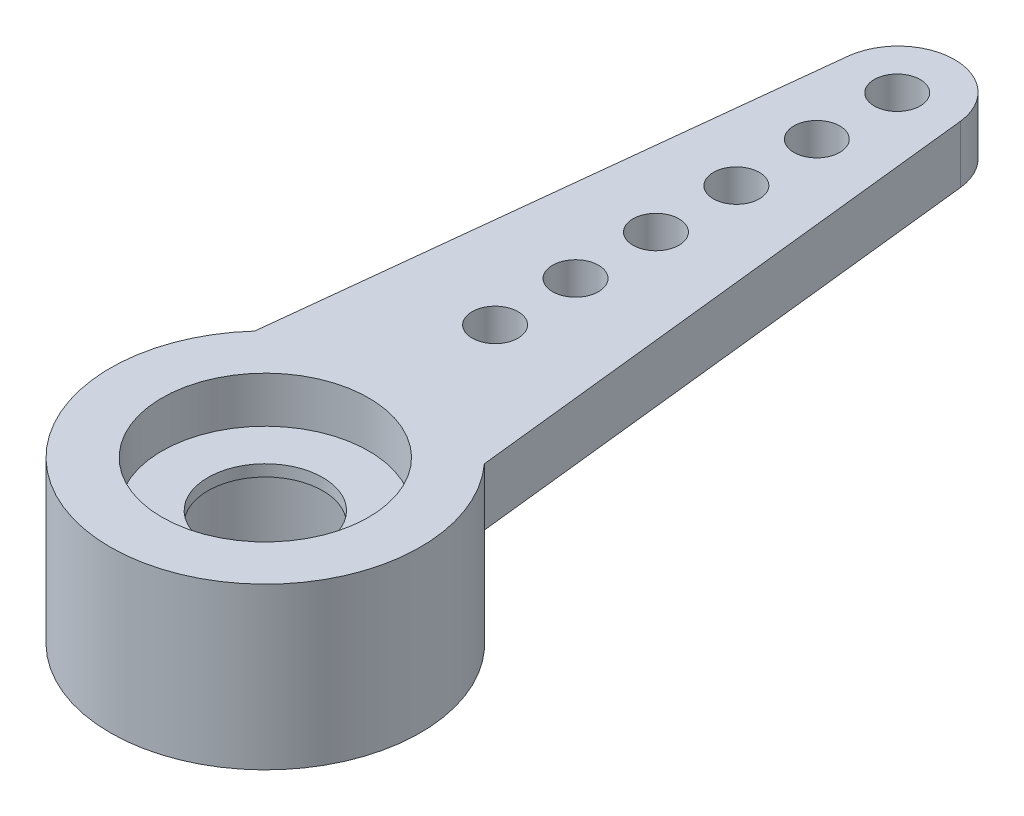
ISO-10303-21;
HEADER;
FILE_DESCRIPTION(('STEP AP214'),'2;1');
FILE_NAME('part.step','',(''),(''),'','','');
FILE_SCHEMA(('AUTOMOTIVE_DESIGN { 1 0 10303 214 1 1 1 1 }'));
ENDSEC;
DATA;
#1=APPLICATION_CONTEXT('core data for automotive mechanical design processes');
#2=APPLICATION_PROTOCOL_DEFINITION('international standard','automotive_design',2000,#1);
#3=PRODUCT_CONTEXT('',#1,'mechanical');
#4=PRODUCT('Part','Part','',(#3));
#5=PRODUCT_RELATED_PRODUCT_CATEGORY('part','',(#4));
#6=PRODUCT_DEFINITION_FORMATION('','',#4);
#7=PRODUCT_DEFINITION_CONTEXT('part definition',#1,'design');
#8=PRODUCT_DEFINITION('design','',#6,#7);
#9=PRODUCT_DEFINITION_SHAPE('','',#8);
#10=(LENGTH_UNIT() NAMED_UNIT(*) SI_UNIT(.MILLI.,.METRE.));
#11=(NAMED_UNIT(*) PLANE_ANGLE_UNIT() SI_UNIT($,.RADIAN.));
#12=(NAMED_UNIT(*) SI_UNIT($,.STERADIAN.) SOLID_ANGLE_UNIT());
#13=UNCERTAINTY_MEASURE_WITH_UNIT(LENGTH_MEASURE(1.E-05),#10,'distance_accuracy_value','');
#14=(GEOMETRIC_REPRESENTATION_CONTEXT(3) GLOBAL_UNCERTAINTY_ASSIGNED_CONTEXT((#13)) GLOBAL_UNIT_ASSIGNED_CONTEXT((#10,
#11,#12)) REPRESENTATION_CONTEXT('',''));
#15=CARTESIAN_POINT('',(0.,0.,0.));
#16=DIRECTION('',(0.,0.,1.));
#17=DIRECTION('',(1.,0.,0.));
#18=AXIS2_PLACEMENT_3D('',#15,#16,#17);
#19=CARTESIAN_POINT('',(0.,0.,-12.192));
#20=DIRECTION('',(0.,1.,0.));
#21=DIRECTION('',(0.,0.,1.));
#22=AXIS2_PLACEMENT_3D('',#19,#20,#21);
#23=CYLINDRICAL_SURFACE('',#22,0.508);
#24=CARTESIAN_POINT('',(0.,3.556,-12.192));
#25=DIRECTION('',(0.,1.,0.));
#26=DIRECTION('',(0.,0.,1.));
#27=AXIS2_PLACEMENT_3D('',#24,#25,#26);
#28=CIRCLE('',#27,0.508);
#29=CARTESIAN_POINT('',(0.,3.556,-11.684));
#30=VERTEX_POINT('',#29);
#31=EDGE_CURVE('E52',#30,#30,#28,.T.);
#32=ORIENTED_EDGE('',*,*,#31,.T.);
#33=EDGE_LOOP('',(#32));
#34=FACE_BOUND('',#33,.T.);
#35=CARTESIAN_POINT('',(0.,2.286,-12.192));
#36=DIRECTION('',(0.,1.,0.));
#37=DIRECTION('',(0.,0.,1.));
#38=AXIS2_PLACEMENT_3D('',#35,#36,#37);
#39=CIRCLE('',#38,0.508);
#40=CARTESIAN_POINT('',(0.,2.286,-11.684));
#41=VERTEX_POINT('',#40);
#42=EDGE_CURVE('E11',#41,#41,#39,.T.);
#43=ORIENTED_EDGE('',*,*,#42,.F.);
#44=EDGE_LOOP('',(#43));
#45=FACE_BOUND('',#44,.T.);
#46=ADVANCED_FACE('F43',(#34,#45),#23,.F.);
#47=CARTESIAN_POINT('',(0.,0.,-10.414));
#48=DIRECTION('',(0.,1.,0.));
#49=DIRECTION('',(0.,0.,1.));
#50=AXIS2_PLACEMENT_3D('',#47,#48,#49);
#51=CYLINDRICAL_SURFACE('',#50,0.508);
#52=CARTESIAN_POINT('',(0.,3.556,-10.414));
#53=DIRECTION('',(0.,1.,0.));
#54=DIRECTION('',(0.,0.,1.));
#55=AXIS2_PLACEMENT_3D('',#52,#53,#54);
#56=CIRCLE('',#55,0.508);
#57=CARTESIAN_POINT('',(0.,3.556,-9.906));
#58=VERTEX_POINT('',#57);
#59=EDGE_CURVE('E174',#58,#58,#56,.T.);
#60=ORIENTED_EDGE('',*,*,#59,.T.);
#61=EDGE_LOOP('',(#60));
#62=FACE_BOUND('',#61,.T.);
#63=CARTESIAN_POINT('',(0.,2.286,-10.414));
#64=DIRECTION('',(0.,1.,0.));
#65=DIRECTION('',(0.,0.,1.));
#66=AXIS2_PLACEMENT_3D('',#63,#64,#65);
#67=CIRCLE('',#66,0.508);
#68=CARTESIAN_POINT('',(0.,2.286,-9.906));
#69=VERTEX_POINT('',#68);
#70=EDGE_CURVE('E178',#69,#69,#67,.T.);
#71=ORIENTED_EDGE('',*,*,#70,.F.);
#72=EDGE_LOOP('',(#71));
#73=FACE_BOUND('',#72,.T.);
#74=ADVANCED_FACE('F208',(#62,#73),#51,.F.);
#75=CARTESIAN_POINT('',(0.,0.,-8.636));
#76=DIRECTION('',(0.,1.,0.));
#77=DIRECTION('',(0.,0.,1.));
#78=AXIS2_PLACEMENT_3D('',#75,#76,#77);
#79=CYLINDRICAL_SURFACE('',#78,0.508);
#80=CARTESIAN_POINT('',(0.,3.556,-8.636));
#81=DIRECTION('',(0.,1.,0.));
#82=DIRECTION('',(0.,0.,1.));
#83=AXIS2_PLACEMENT_3D('',#80,#81,#82);
#84=CIRCLE('',#83,0.508);
#85=CARTESIAN_POINT('',(0.,3.556,-8.128));
#86=VERTEX_POINT('',#85);
#87=EDGE_CURVE('E160',#86,#86,#84,.T.);
#88=ORIENTED_EDGE('',*,*,#87,.T.);
#89=EDGE_LOOP('',(#88));
#90=FACE_BOUND('',#89,.T.);
#91=CARTESIAN_POINT('',(0.,2.286,-8.636));
#92=DIRECTION('',(0.,1.,0.));
#93=DIRECTION('',(0.,0.,1.));
#94=AXIS2_PLACEMENT_3D('',#91,#92,#93);
#95=CIRCLE('',#94,0.508);
#96=CARTESIAN_POINT('',(0.,2.286,-8.128));
#97=VERTEX_POINT('',#96);
#98=EDGE_CURVE('E170',#97,#97,#95,.T.);
#99=ORIENTED_EDGE('',*,*,#98,.F.);
#100=EDGE_LOOP('',(#99));
#101=FACE_BOUND('',#100,.T.);
#102=ADVANCED_FACE('F212',(#90,#101),#79,.F.);
#103=CARTESIAN_POINT('',(0.,3.556,0.));
#104=DIRECTION('',(0.,-1.,0.));
#105=DIRECTION('',(0.,0.,-1.));
#106=AXIS2_PLACEMENT_3D('',#103,#104,#105);
#107=CYLINDRICAL_SURFACE('',#106,2.286);
#108=CARTESIAN_POINT('',(0.,0.,0.));
#109=DIRECTION('',(0.,1.,0.));
#110=DIRECTION('',(0.,0.,1.));
#111=AXIS2_PLACEMENT_3D('',#108,#109,#110);
#112=CIRCLE('',#111,2.286);
#113=CARTESIAN_POINT('',(0.,0.,2.286));
#114=VERTEX_POINT('',#113);
#115=EDGE_CURVE('E136',#114,#114,#112,.T.);
#116=ORIENTED_EDGE('',*,*,#115,.F.);
#117=EDGE_LOOP('',(#116));
#118=FACE_BOUND('',#117,.T.);
#119=CARTESIAN_POINT('',(0.,2.286,0.));
#120=DIRECTION('',(0.,1.,0.));
#121=DIRECTION('',(0.,0.,1.));
#122=AXIS2_PLACEMENT_3D('',#119,#120,#121);
#123=CIRCLE('',#122,2.286);
#124=CARTESIAN_POINT('',(0.,2.286,2.286));
#125=VERTEX_POINT('',#124);
#126=EDGE_CURVE('E259',#125,#125,#123,.F.);
#127=ORIENTED_EDGE('',*,*,#126,.F.);
#128=EDGE_LOOP('',(#127));
#129=FACE_BOUND('',#128,.T.);
#130=ADVANCED_FACE('F201',(#118,#129),#107,.F.);
#131=CARTESIAN_POINT('',(0.,3.556,0.));
#132=DIRECTION('',(0.,-1.,0.));
#133=DIRECTION('',(0.,0.,-1.));
#134=AXIS2_PLACEMENT_3D('',#131,#132,#133);
#135=CYLINDRICAL_SURFACE('',#134,3.429);
#136=CARTESIAN_POINT('',(0.,0.,0.));
#137=DIRECTION('',(0.,1.,0.));
#138=DIRECTION('',(0.,0.,1.));
#139=AXIS2_PLACEMENT_3D('',#136,#137,#138);
#140=CIRCLE('',#139,3.429);
#141=CARTESIAN_POINT('',(0.,0.,3.429));
#142=VERTEX_POINT('',#141);
#143=EDGE_CURVE('E145',#142,#142,#140,.T.);
#144=ORIENTED_EDGE('',*,*,#143,.T.);
#145=EDGE_LOOP('',(#144));
#146=FACE_BOUND('',#145,.T.);
#147=DIRECTION('',(0.,1.,0.));
#148=VECTOR('',#147,1.);
#149=CARTESIAN_POINT('',(-2.54,2.286,-2.30357135769657));
#150=LINE('',#149,#148);
#151=CARTESIAN_POINT('',(-2.54,2.286,-2.30357135769657));
#152=VERTEX_POINT('',#151);
#153=CARTESIAN_POINT('',(-2.54,3.556,-2.30357135769657));
#154=VERTEX_POINT('',#153);
#155=EDGE_CURVE('E61',#152,#154,#150,.T.);
#156=ORIENTED_EDGE('',*,*,#155,.F.);
#157=CARTESIAN_POINT('',(0.,2.286,0.));
#158=DIRECTION('',(0.,1.,0.));
#159=DIRECTION('',(0.,0.,1.));
#160=AXIS2_PLACEMENT_3D('',#157,#158,#159);
#161=CIRCLE('',#160,3.429);
#162=CARTESIAN_POINT('',(2.54,2.286,-2.30357135769657));
#163=VERTEX_POINT('',#162);
#164=EDGE_CURVE('E117',#163,#152,#161,.T.);
#165=ORIENTED_EDGE('',*,*,#164,.F.);
#166=DIRECTION('',(0.,1.,0.));
#167=VECTOR('',#166,1.);
#168=CARTESIAN_POINT('',(2.54,2.286,-2.30357135769657));
#169=LINE('',#168,#167);
#170=CARTESIAN_POINT('',(2.54,3.556,-2.30357135769657));
#171=VERTEX_POINT('',#170);
#172=EDGE_CURVE('E92',#163,#171,#169,.T.);
#173=ORIENTED_EDGE('',*,*,#172,.T.);
#174=CARTESIAN_POINT('',(0.,3.556,0.));
#175=DIRECTION('',(0.,1.,0.));
#176=DIRECTION('',(0.,0.,1.));
#177=AXIS2_PLACEMENT_3D('',#174,#175,#176);
#178=CIRCLE('',#177,3.429);
#179=EDGE_CURVE('E149',#154,#171,#178,.T.);
#180=ORIENTED_EDGE('',*,*,#179,.F.);
#181=EDGE_LOOP('',(#156,#165,#173,#180));
#182=FACE_BOUND('',#181,.T.);
#183=ADVANCED_FACE('F191',(#146,#182),#135,.T.);
#184=CARTESIAN_POINT('',(0.,3.556,0.));
#185=DIRECTION('',(0.,1.,0.));
#186=DIRECTION('',(0.,0.,1.));
#187=AXIS2_PLACEMENT_3D('',#184,#185,#186);
#188=PLANE('',#187);
#189=CARTESIAN_POINT('',(0.,3.556,-13.97));
#190=DIRECTION('',(0.,1.,0.));
#191=DIRECTION('',(0.,0.,1.));
#192=AXIS2_PLACEMENT_3D('',#189,#190,#191);
#193=CIRCLE('',#192,0.508);
#194=CARTESIAN_POINT('',(0.,3.556,-13.462));
#195=VERTEX_POINT('',#194);
#196=EDGE_CURVE('E280',#195,#195,#193,.T.);
#197=ORIENTED_EDGE('',*,*,#196,.F.);
#198=EDGE_LOOP('',(#197));
#199=FACE_BOUND('',#198,.T.);
#200=CARTESIAN_POINT('',(0.,3.556,-6.858));
#201=DIRECTION('',(0.,1.,0.));
#202=DIRECTION('',(0.,0.,1.));
#203=AXIS2_PLACEMENT_3D('',#200,#201,#202);
#204=CIRCLE('',#203,0.508);
#205=CARTESIAN_POINT('',(0.,3.556,-6.35));
#206=VERTEX_POINT('',#205);
#207=EDGE_CURVE('E276',#206,#206,#204,.T.);
#208=ORIENTED_EDGE('',*,*,#207,.F.);
#209=EDGE_LOOP('',(#208));
#210=FACE_BOUND('',#209,.T.);
#211=CARTESIAN_POINT('',(0.,3.556,-5.08));
#212=DIRECTION('',(0.,1.,0.));
#213=DIRECTION('',(0.,0.,1.));
#214=AXIS2_PLACEMENT_3D('',#211,#212,#213);
#215=CIRCLE('',#214,0.508);
#216=CARTESIAN_POINT('',(0.,3.556,-4.572));
#217=VERTEX_POINT('',#216);
#218=EDGE_CURVE('E166',#217,#217,#215,.T.);
#219=ORIENTED_EDGE('',*,*,#218,.F.);
#220=EDGE_LOOP('',(#219));
#221=FACE_BOUND('',#220,.T.);
#222=ORIENTED_EDGE('',*,*,#179,.T.);
#223=DIRECTION('',(-0.108941168435119,0.,-0.994048198942079));
#224=VECTOR('',#223,1.);
#225=CARTESIAN_POINT('',(2.75931495587774,3.556,-0.302402836898391));
#226=LINE('',#225,#224);
#227=CARTESIAN_POINT('',(1.24451166089778,3.556,-14.1244272263572));
#228=VERTEX_POINT('',#227);
#229=EDGE_CURVE('E127',#171,#228,#226,.T.);
#230=ORIENTED_EDGE('',*,*,#229,.T.);
#231=CARTESIAN_POINT('',(0.,3.556,-13.9880369038219));
#232=DIRECTION('',(0.,1.,0.));
#233=DIRECTION('',(0.,0.,1.));
#234=AXIS2_PLACEMENT_3D('',#231,#232,#233);
#235=CIRCLE('',#234,1.25196309617809);
#236=CARTESIAN_POINT('',(-1.24451166089778,3.556,-14.1244272263572));
#237=VERTEX_POINT('',#236);
#238=EDGE_CURVE('E110',#237,#228,#235,.F.);
#239=ORIENTED_EDGE('',*,*,#238,.F.);
#240=DIRECTION('',(0.108941168435119,0.,-0.994048198942079));
#241=VECTOR('',#240,1.);
#242=CARTESIAN_POINT('',(-2.75931495587774,3.556,-0.302402836898391));
#243=LINE('',#242,#241);
#244=EDGE_CURVE('E84',#154,#237,#243,.T.);
#245=ORIENTED_EDGE('',*,*,#244,.F.);
#246=EDGE_LOOP('',(#222,#230,#239,#245));
#247=FACE_BOUND('',#246,.T.);
#248=CARTESIAN_POINT('',(0.,3.556,0.));
#249=DIRECTION('',(0.,1.,0.));
#250=DIRECTION('',(0.,0.,1.));
#251=AXIS2_PLACEMENT_3D('',#248,#249,#250);
#252=CIRCLE('',#251,2.286);
#253=CARTESIAN_POINT('',(0.,3.556,2.286));
#254=VERTEX_POINT('',#253);
#255=EDGE_CURVE('E141',#254,#254,#252,.T.);
#256=ORIENTED_EDGE('',*,*,#255,.F.);
#257=EDGE_LOOP('',(#256));
#258=FACE_BOUND('',#257,.T.);
#259=ORIENTED_EDGE('',*,*,#87,.F.);
#260=EDGE_LOOP('',(#259));
#261=FACE_BOUND('',#260,.T.);
#262=ORIENTED_EDGE('',*,*,#59,.F.);
#263=EDGE_LOOP('',(#262));
#264=FACE_BOUND('',#263,.T.);
#265=ORIENTED_EDGE('',*,*,#31,.F.);
#266=EDGE_LOOP('',(#265));
#267=FACE_BOUND('',#266,.T.);
#268=ADVANCED_FACE('F188',(#199,#210,#221,#247,#258,#261,#264,#267),#188,.T.);
#269=CARTESIAN_POINT('',(0.,0.,0.));
#270=DIRECTION('',(0.,1.,0.));
#271=DIRECTION('',(0.,0.,1.));
#272=AXIS2_PLACEMENT_3D('',#269,#270,#271);
#273=PLANE('',#272);
#274=ORIENTED_EDGE('',*,*,#143,.F.);
#275=EDGE_LOOP('',(#274));
#276=FACE_BOUND('',#275,.T.);
#277=ORIENTED_EDGE('',*,*,#115,.T.);
#278=EDGE_LOOP('',(#277));
#279=FACE_BOUND('',#278,.T.);
#280=ADVANCED_FACE('F190',(#276,#279),#273,.F.);
#281=CARTESIAN_POINT('',(0.,2.54,0.));
#282=DIRECTION('',(0.,1.,0.));
#283=DIRECTION('',(0.,0.,1.));
#284=AXIS2_PLACEMENT_3D('',#281,#282,#283);
#285=CIRCLE('',#284,2.286);
#286=CARTESIAN_POINT('',(0.,2.54,2.286));
#287=VERTEX_POINT('',#286);
#288=EDGE_CURVE('E153',#287,#287,#285,.T.);
#289=ORIENTED_EDGE('',*,*,#288,.F.);
#290=EDGE_LOOP('',(#289));
#291=FACE_BOUND('',#290,.T.);
#292=ORIENTED_EDGE('',*,*,#255,.T.);
#293=EDGE_LOOP('',(#292));
#294=FACE_BOUND('',#293,.T.);
#295=ADVANCED_FACE('F198',(#291,#294),#107,.F.);
#296=CARTESIAN_POINT('',(-2.75931495587774,2.286,-0.302402836898391));
#297=DIRECTION('',(0.994048198942079,0.,0.108941168435119));
#298=DIRECTION('',(0.108941168435119,0.,-0.994048198942079));
#299=AXIS2_PLACEMENT_3D('',#296,#297,#298);
#300=PLANE('',#299);
#301=ORIENTED_EDGE('',*,*,#244,.T.);
#302=DIRECTION('',(0.,1.,0.));
#303=VECTOR('',#302,1.);
#304=CARTESIAN_POINT('',(-1.24451166089778,2.286,-14.1244272263572));
#305=LINE('',#304,#303);
#306=CARTESIAN_POINT('',(-1.24451166089778,2.286,-14.1244272263572));
#307=VERTEX_POINT('',#306);
#308=EDGE_CURVE('E113',#307,#237,#305,.T.);
#309=ORIENTED_EDGE('',*,*,#308,.F.);
#310=DIRECTION('',(0.108941168435119,0.,-0.994048198942079));
#311=VECTOR('',#310,1.);
#312=CARTESIAN_POINT('',(-2.75931495587774,2.286,-0.302402836898391));
#313=LINE('',#312,#311);
#314=EDGE_CURVE('E68',#152,#307,#313,.T.);
#315=ORIENTED_EDGE('',*,*,#314,.F.);
#316=ORIENTED_EDGE('',*,*,#155,.T.);
#317=EDGE_LOOP('',(#301,#309,#315,#316));
#318=FACE_BOUND('',#317,.T.);
#319=ADVANCED_FACE('F241',(#318),#300,.F.);
#320=CARTESIAN_POINT('',(0.,2.286,-13.9880369038219));
#321=DIRECTION('',(0.,1.,0.));
#322=DIRECTION('',(0.,0.,1.));
#323=AXIS2_PLACEMENT_3D('',#320,#321,#322);
#324=CYLINDRICAL_SURFACE('',#323,1.25196309617809);
#325=ORIENTED_EDGE('',*,*,#238,.T.);
#326=DIRECTION('',(0.,1.,0.));
#327=VECTOR('',#326,1.);
#328=CARTESIAN_POINT('',(1.24451166089778,2.286,-14.1244272263572));
#329=LINE('',#328,#327);
#330=CARTESIAN_POINT('',(1.24451166089778,2.286,-14.1244272263572));
#331=VERTEX_POINT('',#330);
#332=EDGE_CURVE('E107',#331,#228,#329,.T.);
#333=ORIENTED_EDGE('',*,*,#332,.F.);
#334=CARTESIAN_POINT('',(0.,2.286,-13.9880369038219));
#335=DIRECTION('',(0.,1.,0.));
#336=DIRECTION('',(0.,0.,1.));
#337=AXIS2_PLACEMENT_3D('',#334,#335,#336);
#338=CIRCLE('',#337,1.25196309617809);
#339=EDGE_CURVE('E97',#307,#331,#338,.F.);
#340=ORIENTED_EDGE('',*,*,#339,.F.);
#341=ORIENTED_EDGE('',*,*,#308,.T.);
#342=EDGE_LOOP('',(#325,#333,#340,#341));
#343=FACE_BOUND('',#342,.T.);
#344=ADVANCED_FACE('F108',(#343),#324,.T.);
#345=CARTESIAN_POINT('',(2.75931495587774,2.286,-0.302402836898391));
#346=DIRECTION('',(0.994048198942079,0.,-0.108941168435119));
#347=DIRECTION('',(-0.108941168435119,0.,-0.994048198942079));
#348=AXIS2_PLACEMENT_3D('',#345,#346,#347);
#349=PLANE('',#348);
#350=ORIENTED_EDGE('',*,*,#229,.F.);
#351=ORIENTED_EDGE('',*,*,#172,.F.);
#352=DIRECTION('',(-0.108941168435119,0.,-0.994048198942079));
#353=VECTOR('',#352,1.);
#354=CARTESIAN_POINT('',(2.75931495587774,2.286,-0.302402836898391));
#355=LINE('',#354,#353);
#356=EDGE_CURVE('E101',#163,#331,#355,.T.);
#357=ORIENTED_EDGE('',*,*,#356,.T.);
#358=ORIENTED_EDGE('',*,*,#332,.T.);
#359=EDGE_LOOP('',(#350,#351,#357,#358));
#360=FACE_BOUND('',#359,.T.);
#361=ADVANCED_FACE('F115',(#360),#349,.T.);
#362=CARTESIAN_POINT('',(0.,2.286,0.));
#363=DIRECTION('',(0.,1.,0.));
#364=DIRECTION('',(0.,0.,1.));
#365=AXIS2_PLACEMENT_3D('',#362,#363,#364);
#366=PLANE('',#365);
#367=CARTESIAN_POINT('',(0.,2.286,-13.97));
#368=DIRECTION('',(0.,1.,0.));
#369=DIRECTION('',(0.,0.,1.));
#370=AXIS2_PLACEMENT_3D('',#367,#368,#369);
#371=CIRCLE('',#370,0.508);
#372=CARTESIAN_POINT('',(0.,2.286,-13.462));
#373=VERTEX_POINT('',#372);
#374=EDGE_CURVE('E46',#373,#373,#371,.T.);
#375=ORIENTED_EDGE('',*,*,#374,.T.);
#376=EDGE_LOOP('',(#375));
#377=FACE_BOUND('',#376,.T.);
#378=CARTESIAN_POINT('',(0.,2.286,-6.858));
#379=DIRECTION('',(0.,1.,0.));
#380=DIRECTION('',(0.,0.,1.));
#381=AXIS2_PLACEMENT_3D('',#378,#379,#380);
#382=CIRCLE('',#381,0.508);
#383=CARTESIAN_POINT('',(0.,2.286,-6.35));
#384=VERTEX_POINT('',#383);
#385=EDGE_CURVE('E272',#384,#384,#382,.T.);
#386=ORIENTED_EDGE('',*,*,#385,.T.);
#387=EDGE_LOOP('',(#386));
#388=FACE_BOUND('',#387,.T.);
#389=CARTESIAN_POINT('',(0.,2.286,-5.08));
#390=DIRECTION('',(0.,1.,0.));
#391=DIRECTION('',(0.,0.,1.));
#392=AXIS2_PLACEMENT_3D('',#389,#390,#391);
#393=CIRCLE('',#392,0.508);
#394=CARTESIAN_POINT('',(0.,2.286,-4.572));
#395=VERTEX_POINT('',#394);
#396=EDGE_CURVE('E161',#395,#395,#393,.T.);
#397=ORIENTED_EDGE('',*,*,#396,.T.);
#398=EDGE_LOOP('',(#397));
#399=FACE_BOUND('',#398,.T.);
#400=ORIENTED_EDGE('',*,*,#164,.T.);
#401=ORIENTED_EDGE('',*,*,#314,.T.);
#402=ORIENTED_EDGE('',*,*,#339,.T.);
#403=ORIENTED_EDGE('',*,*,#356,.F.);
#404=EDGE_LOOP('',(#400,#401,#402,#403));
#405=FACE_BOUND('',#404,.T.);
#406=ORIENTED_EDGE('',*,*,#98,.T.);
#407=EDGE_LOOP('',(#406));
#408=FACE_BOUND('',#407,.T.);
#409=ORIENTED_EDGE('',*,*,#70,.T.);
#410=EDGE_LOOP('',(#409));
#411=FACE_BOUND('',#410,.T.);
#412=ORIENTED_EDGE('',*,*,#42,.T.);
#413=EDGE_LOOP('',(#412));
#414=FACE_BOUND('',#413,.T.);
#415=ADVANCED_FACE('F99',(#377,#388,#399,#405,#408,#411,#414),#366,.F.);
#416=CARTESIAN_POINT('',(0.,2.286,0.));
#417=DIRECTION('',(0.,1.,0.));
#418=DIRECTION('',(0.,0.,1.));
#419=AXIS2_PLACEMENT_3D('',#416,#417,#418);
#420=CYLINDRICAL_SURFACE('',#419,1.27);
#421=CARTESIAN_POINT('',(0.,2.286,0.));
#422=DIRECTION('',(0.,1.,0.));
#423=DIRECTION('',(0.,0.,1.));
#424=AXIS2_PLACEMENT_3D('',#421,#422,#423);
#425=CIRCLE('',#424,1.27);
#426=CARTESIAN_POINT('',(0.,2.286,1.27));
#427=VERTEX_POINT('',#426);
#428=EDGE_CURVE('E129',#427,#427,#425,.T.);
#429=ORIENTED_EDGE('',*,*,#428,.F.);
#430=EDGE_LOOP('',(#429));
#431=FACE_BOUND('',#430,.T.);
#432=CARTESIAN_POINT('',(0.,2.54,0.));
#433=DIRECTION('',(0.,1.,0.));
#434=DIRECTION('',(0.,0.,1.));
#435=AXIS2_PLACEMENT_3D('',#432,#433,#434);
#436=CIRCLE('',#435,1.27);
#437=CARTESIAN_POINT('',(0.,2.54,1.27));
#438=VERTEX_POINT('',#437);
#439=EDGE_CURVE('E165',#438,#438,#436,.T.);
#440=ORIENTED_EDGE('',*,*,#439,.T.);
#441=EDGE_LOOP('',(#440));
#442=FACE_BOUND('',#441,.T.);
#443=ADVANCED_FACE('F225',(#431,#442),#420,.F.);
#444=CARTESIAN_POINT('',(0.,2.286,0.));
#445=DIRECTION('',(0.,1.,0.));
#446=DIRECTION('',(0.,0.,1.));
#447=AXIS2_PLACEMENT_3D('',#444,#445,#446);
#448=PLANE('',#447);
#449=ORIENTED_EDGE('',*,*,#126,.T.);
#450=EDGE_LOOP('',(#449));
#451=FACE_BOUND('',#450,.T.);
#452=ORIENTED_EDGE('',*,*,#428,.T.);
#453=EDGE_LOOP('',(#452));
#454=FACE_BOUND('',#453,.T.);
#455=ADVANCED_FACE('F233',(#451,#454),#448,.F.);
#456=CARTESIAN_POINT('',(0.,2.54,0.));
#457=DIRECTION('',(0.,1.,0.));
#458=DIRECTION('',(0.,0.,1.));
#459=AXIS2_PLACEMENT_3D('',#456,#457,#458);
#460=PLANE('',#459);
#461=ORIENTED_EDGE('',*,*,#288,.T.);
#462=EDGE_LOOP('',(#461));
#463=FACE_BOUND('',#462,.T.);
#464=ORIENTED_EDGE('',*,*,#439,.F.);
#465=EDGE_LOOP('',(#464));
#466=FACE_BOUND('',#465,.T.);
#467=ADVANCED_FACE('F299',(#463,#466),#460,.T.);
#468=CARTESIAN_POINT('',(0.,0.,-5.08));
#469=DIRECTION('',(0.,1.,0.));
#470=DIRECTION('',(0.,0.,1.));
#471=AXIS2_PLACEMENT_3D('',#468,#469,#470);
#472=CYLINDRICAL_SURFACE('',#471,0.508);
#473=ORIENTED_EDGE('',*,*,#218,.T.);
#474=EDGE_LOOP('',(#473));
#475=FACE_BOUND('',#474,.T.);
#476=ORIENTED_EDGE('',*,*,#396,.F.);
#477=EDGE_LOOP('',(#476));
#478=FACE_BOUND('',#477,.T.);
#479=ADVANCED_FACE('F293',(#475,#478),#472,.F.);
#480=CARTESIAN_POINT('',(0.,0.,-6.858));
#481=DIRECTION('',(0.,1.,0.));
#482=DIRECTION('',(0.,0.,1.));
#483=AXIS2_PLACEMENT_3D('',#480,#481,#482);
#484=CYLINDRICAL_SURFACE('',#483,0.508);
#485=ORIENTED_EDGE('',*,*,#207,.T.);
#486=EDGE_LOOP('',(#485));
#487=FACE_BOUND('',#486,.T.);
#488=ORIENTED_EDGE('',*,*,#385,.F.);
#489=EDGE_LOOP('',(#488));
#490=FACE_BOUND('',#489,.T.);
#491=ADVANCED_FACE('F288',(#487,#490),#484,.F.);
#492=CARTESIAN_POINT('',(0.,0.,-13.97));
#493=DIRECTION('',(0.,1.,0.));
#494=DIRECTION('',(0.,0.,1.));
#495=AXIS2_PLACEMENT_3D('',#492,#493,#494);
#496=CYLINDRICAL_SURFACE('',#495,0.508);
#497=ORIENTED_EDGE('',*,*,#196,.T.);
#498=EDGE_LOOP('',(#497));
#499=FACE_BOUND('',#498,.T.);
#500=ORIENTED_EDGE('',*,*,#374,.F.);
#501=EDGE_LOOP('',(#500));
#502=FACE_BOUND('',#501,.T.);
#503=ADVANCED_FACE('F286',(#499,#502),#496,.F.);
#504=CLOSED_SHELL('',(#46,#74,#102,#130,#183,#268,#280,#295,#319,#344,#361,#415,#443,#455,#467,
#479,#491,#503));
#505=MANIFOLD_SOLID_BREP('B2',#504);
#506=ADVANCED_BREP_SHAPE_REPRESENTATION('',(#18,#505),#14);
#507=SHAPE_DEFINITION_REPRESENTATION(#9,#506);
ENDSEC;
END-ISO-10303-21;
